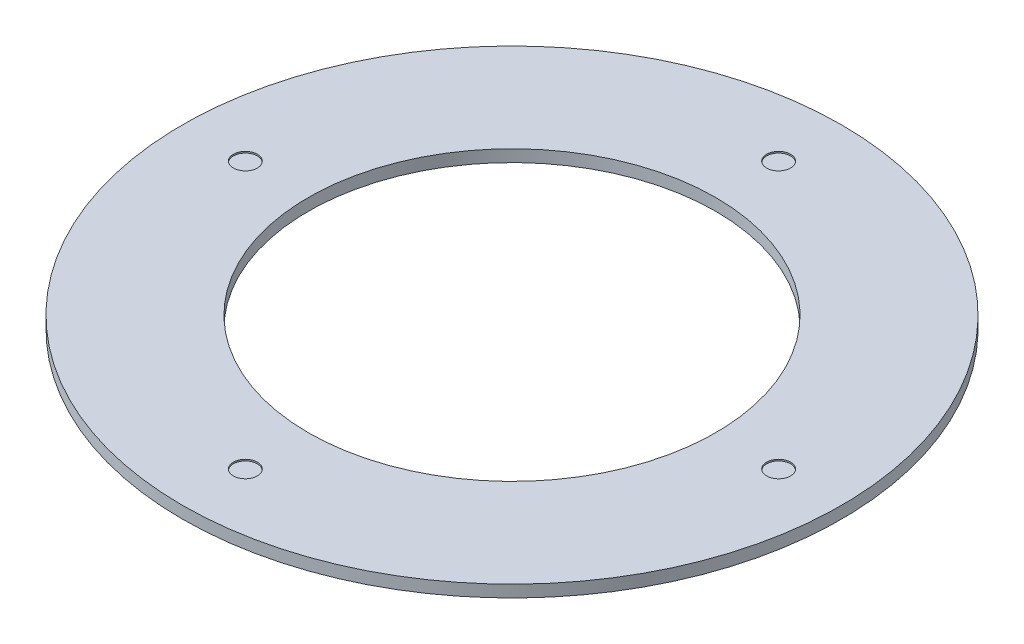
ISO-10303-21;
HEADER;
FILE_DESCRIPTION(('STEP AP214'),'2;1');
FILE_NAME('part.step','',(''),(''),'','','');
FILE_SCHEMA(('AUTOMOTIVE_DESIGN { 1 0 10303 214 1 1 1 1 }'));
ENDSEC;
DATA;
#1=APPLICATION_CONTEXT('core data for automotive mechanical design processes');
#2=APPLICATION_PROTOCOL_DEFINITION('international standard','automotive_design',2000,#1);
#3=PRODUCT_CONTEXT('',#1,'mechanical');
#4=PRODUCT('Part','Part','',(#3));
#5=PRODUCT_RELATED_PRODUCT_CATEGORY('part','',(#4));
#6=PRODUCT_DEFINITION_FORMATION('','',#4);
#7=PRODUCT_DEFINITION_CONTEXT('part definition',#1,'design');
#8=PRODUCT_DEFINITION('design','',#6,#7);
#9=PRODUCT_DEFINITION_SHAPE('','',#8);
#10=(LENGTH_UNIT() NAMED_UNIT(*) SI_UNIT(.MILLI.,.METRE.));
#11=(NAMED_UNIT(*) PLANE_ANGLE_UNIT() SI_UNIT($,.RADIAN.));
#12=(NAMED_UNIT(*) SI_UNIT($,.STERADIAN.) SOLID_ANGLE_UNIT());
#13=UNCERTAINTY_MEASURE_WITH_UNIT(LENGTH_MEASURE(1.E-05),#10,'distance_accuracy_value','');
#14=(GEOMETRIC_REPRESENTATION_CONTEXT(3) GLOBAL_UNCERTAINTY_ASSIGNED_CONTEXT((#13)) GLOBAL_UNIT_ASSIGNED_CONTEXT((#10,
#11,#12)) REPRESENTATION_CONTEXT('',''));
#15=CARTESIAN_POINT('',(0.,0.,0.));
#16=DIRECTION('',(0.,0.,1.));
#17=DIRECTION('',(1.,0.,0.));
#18=AXIS2_PLACEMENT_3D('',#15,#16,#17);
#19=CARTESIAN_POINT('',(0.,2.,0.));
#20=DIRECTION('',(0.,-1.,0.));
#21=DIRECTION('',(0.,0.,-1.));
#22=AXIS2_PLACEMENT_3D('',#19,#20,#21);
#23=CYLINDRICAL_SURFACE('',#22,55.);
#24=CARTESIAN_POINT('',(0.,2.,0.));
#25=DIRECTION('',(0.,1.,0.));
#26=DIRECTION('',(0.,0.,1.));
#27=AXIS2_PLACEMENT_3D('',#24,#25,#26);
#28=CIRCLE('',#27,55.);
#29=CARTESIAN_POINT('',(0.,2.,55.));
#30=VERTEX_POINT('',#29);
#31=EDGE_CURVE('E10',#30,#30,#28,.T.);
#32=ORIENTED_EDGE('',*,*,#31,.F.);
#33=EDGE_LOOP('',(#32));
#34=FACE_BOUND('',#33,.T.);
#35=CARTESIAN_POINT('',(0.,0.,0.));
#36=DIRECTION('',(0.,1.,0.));
#37=DIRECTION('',(0.,0.,1.));
#38=AXIS2_PLACEMENT_3D('',#35,#36,#37);
#39=CIRCLE('',#38,55.);
#40=CARTESIAN_POINT('',(0.,0.,55.));
#41=VERTEX_POINT('',#40);
#42=EDGE_CURVE('E44',#41,#41,#39,.T.);
#43=ORIENTED_EDGE('',*,*,#42,.T.);
#44=EDGE_LOOP('',(#43));
#45=FACE_BOUND('',#44,.T.);
#46=ADVANCED_FACE('F36',(#34,#45),#23,.T.);
#47=CARTESIAN_POINT('',(0.,2.,0.));
#48=DIRECTION('',(0.,1.,0.));
#49=DIRECTION('',(0.,0.,1.));
#50=AXIS2_PLACEMENT_3D('',#47,#48,#49);
#51=PLANE('',#50);
#52=CARTESIAN_POINT('',(0.,2.,0.));
#53=DIRECTION('',(0.,1.,0.));
#54=DIRECTION('',(0.,0.,1.));
#55=AXIS2_PLACEMENT_3D('',#52,#53,#54);
#56=CIRCLE('',#55,34.);
#57=CARTESIAN_POINT('',(0.,2.,34.));
#58=VERTEX_POINT('',#57);
#59=EDGE_CURVE('E83',#58,#58,#56,.T.);
#60=ORIENTED_EDGE('',*,*,#59,.F.);
#61=EDGE_LOOP('',(#60));
#62=FACE_BOUND('',#61,.T.);
#63=CARTESIAN_POINT('',(0.,2.,44.5));
#64=DIRECTION('',(0.,1.,0.));
#65=DIRECTION('',(0.,0.,1.));
#66=AXIS2_PLACEMENT_3D('',#63,#64,#65);
#67=CIRCLE('',#66,2.);
#68=CARTESIAN_POINT('',(0.,2.,46.5));
#69=VERTEX_POINT('',#68);
#70=EDGE_CURVE('E76',#69,#69,#67,.T.);
#71=ORIENTED_EDGE('',*,*,#70,.F.);
#72=EDGE_LOOP('',(#71));
#73=FACE_BOUND('',#72,.T.);
#74=CARTESIAN_POINT('',(44.5,2.,0.));
#75=DIRECTION('',(0.,1.,0.));
#76=DIRECTION('',(0.,0.,1.));
#77=AXIS2_PLACEMENT_3D('',#74,#75,#76);
#78=CIRCLE('',#77,2.);
#79=CARTESIAN_POINT('',(44.5,2.,2.));
#80=VERTEX_POINT('',#79);
#81=EDGE_CURVE('E72',#80,#80,#78,.T.);
#82=ORIENTED_EDGE('',*,*,#81,.F.);
#83=EDGE_LOOP('',(#82));
#84=FACE_BOUND('',#83,.T.);
#85=CARTESIAN_POINT('',(0.,2.,-44.5));
#86=DIRECTION('',(0.,1.,0.));
#87=DIRECTION('',(0.,0.,1.));
#88=AXIS2_PLACEMENT_3D('',#85,#86,#87);
#89=CIRCLE('',#88,2.);
#90=CARTESIAN_POINT('',(0.,2.,-42.5));
#91=VERTEX_POINT('',#90);
#92=EDGE_CURVE('E64',#91,#91,#89,.T.);
#93=ORIENTED_EDGE('',*,*,#92,.F.);
#94=EDGE_LOOP('',(#93));
#95=FACE_BOUND('',#94,.T.);
#96=CARTESIAN_POINT('',(-44.5,2.,0.));
#97=DIRECTION('',(0.,1.,0.));
#98=DIRECTION('',(0.,0.,1.));
#99=AXIS2_PLACEMENT_3D('',#96,#97,#98);
#100=CIRCLE('',#99,2.);
#101=CARTESIAN_POINT('',(-44.5,2.,2.));
#102=VERTEX_POINT('',#101);
#103=EDGE_CURVE('E56',#102,#102,#100,.T.);
#104=ORIENTED_EDGE('',*,*,#103,.F.);
#105=EDGE_LOOP('',(#104));
#106=FACE_BOUND('',#105,.T.);
#107=ORIENTED_EDGE('',*,*,#31,.T.);
#108=EDGE_LOOP('',(#107));
#109=FACE_BOUND('',#108,.T.);
#110=ADVANCED_FACE('F106',(#62,#73,#84,#95,#106,#109),#51,.T.);
#111=CARTESIAN_POINT('',(0.,0.,0.));
#112=DIRECTION('',(0.,1.,0.));
#113=DIRECTION('',(0.,0.,1.));
#114=AXIS2_PLACEMENT_3D('',#111,#112,#113);
#115=PLANE('',#114);
#116=CARTESIAN_POINT('',(0.,0.,0.));
#117=DIRECTION('',(0.,1.,0.));
#118=DIRECTION('',(0.,0.,1.));
#119=AXIS2_PLACEMENT_3D('',#116,#117,#118);
#120=CIRCLE('',#119,34.);
#121=CARTESIAN_POINT('',(0.,0.,34.));
#122=VERTEX_POINT('',#121);
#123=EDGE_CURVE('E39',#122,#122,#120,.T.);
#124=ORIENTED_EDGE('',*,*,#123,.T.);
#125=EDGE_LOOP('',(#124));
#126=FACE_BOUND('',#125,.T.);
#127=ORIENTED_EDGE('',*,*,#42,.F.);
#128=EDGE_LOOP('',(#127));
#129=FACE_BOUND('',#128,.T.);
#130=ADVANCED_FACE('F92',(#126,#129),#115,.F.);
#131=CARTESIAN_POINT('',(-44.5,1.75,0.));
#132=DIRECTION('',(0.,1.,0.));
#133=DIRECTION('',(0.,0.,1.));
#134=AXIS2_PLACEMENT_3D('',#131,#132,#133);
#135=CYLINDRICAL_SURFACE('',#134,2.);
#136=CARTESIAN_POINT('',(-44.5,1.75,0.));
#137=DIRECTION('',(0.,1.,0.));
#138=DIRECTION('',(0.,0.,1.));
#139=AXIS2_PLACEMENT_3D('',#136,#137,#138);
#140=CIRCLE('',#139,2.);
#141=CARTESIAN_POINT('',(-44.5,1.75,2.));
#142=VERTEX_POINT('',#141);
#143=EDGE_CURVE('E52',#142,#142,#140,.T.);
#144=ORIENTED_EDGE('',*,*,#143,.F.);
#145=EDGE_LOOP('',(#144));
#146=FACE_BOUND('',#145,.T.);
#147=ORIENTED_EDGE('',*,*,#103,.T.);
#148=EDGE_LOOP('',(#147));
#149=FACE_BOUND('',#148,.T.);
#150=ADVANCED_FACE('F117',(#146,#149),#135,.F.);
#151=CARTESIAN_POINT('',(-44.5,1.75,0.));
#152=DIRECTION('',(0.,1.,0.));
#153=DIRECTION('',(0.,0.,1.));
#154=AXIS2_PLACEMENT_3D('',#151,#152,#153);
#155=PLANE('',#154);
#156=ORIENTED_EDGE('',*,*,#143,.T.);
#157=EDGE_LOOP('',(#156));
#158=FACE_BOUND('',#157,.T.);
#159=ADVANCED_FACE('F121',(#158),#155,.T.);
#160=CARTESIAN_POINT('',(0.,1.75,-44.5));
#161=DIRECTION('',(0.,1.,0.));
#162=DIRECTION('',(0.,0.,1.));
#163=AXIS2_PLACEMENT_3D('',#160,#161,#162);
#164=CYLINDRICAL_SURFACE('',#163,2.);
#165=CARTESIAN_POINT('',(0.,1.75,-44.5));
#166=DIRECTION('',(0.,1.,0.));
#167=DIRECTION('',(0.,0.,1.));
#168=AXIS2_PLACEMENT_3D('',#165,#166,#167);
#169=CIRCLE('',#168,2.);
#170=CARTESIAN_POINT('',(0.,1.75,-42.5));
#171=VERTEX_POINT('',#170);
#172=EDGE_CURVE('E60',#171,#171,#169,.T.);
#173=ORIENTED_EDGE('',*,*,#172,.F.);
#174=EDGE_LOOP('',(#173));
#175=FACE_BOUND('',#174,.T.);
#176=ORIENTED_EDGE('',*,*,#92,.T.);
#177=EDGE_LOOP('',(#176));
#178=FACE_BOUND('',#177,.T.);
#179=ADVANCED_FACE('F126',(#175,#178),#164,.F.);
#180=CARTESIAN_POINT('',(0.,1.75,-44.5));
#181=DIRECTION('',(0.,1.,0.));
#182=DIRECTION('',(0.,0.,1.));
#183=AXIS2_PLACEMENT_3D('',#180,#181,#182);
#184=PLANE('',#183);
#185=ORIENTED_EDGE('',*,*,#172,.T.);
#186=EDGE_LOOP('',(#185));
#187=FACE_BOUND('',#186,.T.);
#188=ADVANCED_FACE('F129',(#187),#184,.T.);
#189=CARTESIAN_POINT('',(44.5,1.75,0.));
#190=DIRECTION('',(0.,1.,0.));
#191=DIRECTION('',(0.,0.,1.));
#192=AXIS2_PLACEMENT_3D('',#189,#190,#191);
#193=CYLINDRICAL_SURFACE('',#192,2.);
#194=CARTESIAN_POINT('',(44.5,1.75,0.));
#195=DIRECTION('',(0.,1.,0.));
#196=DIRECTION('',(0.,0.,1.));
#197=AXIS2_PLACEMENT_3D('',#194,#195,#196);
#198=CIRCLE('',#197,2.);
#199=CARTESIAN_POINT('',(44.5,1.75,2.));
#200=VERTEX_POINT('',#199);
#201=EDGE_CURVE('E68',#200,#200,#198,.T.);
#202=ORIENTED_EDGE('',*,*,#201,.F.);
#203=EDGE_LOOP('',(#202));
#204=FACE_BOUND('',#203,.T.);
#205=ORIENTED_EDGE('',*,*,#81,.T.);
#206=EDGE_LOOP('',(#205));
#207=FACE_BOUND('',#206,.T.);
#208=ADVANCED_FACE('F132',(#204,#207),#193,.F.);
#209=CARTESIAN_POINT('',(44.5,1.75,0.));
#210=DIRECTION('',(0.,1.,0.));
#211=DIRECTION('',(0.,0.,1.));
#212=AXIS2_PLACEMENT_3D('',#209,#210,#211);
#213=PLANE('',#212);
#214=ORIENTED_EDGE('',*,*,#201,.T.);
#215=EDGE_LOOP('',(#214));
#216=FACE_BOUND('',#215,.T.);
#217=ADVANCED_FACE('F137',(#216),#213,.T.);
#218=CARTESIAN_POINT('',(0.,1.75,44.5));
#219=DIRECTION('',(0.,1.,0.));
#220=DIRECTION('',(0.,0.,1.));
#221=AXIS2_PLACEMENT_3D('',#218,#219,#220);
#222=CYLINDRICAL_SURFACE('',#221,2.);
#223=CARTESIAN_POINT('',(0.,1.75,44.5));
#224=DIRECTION('',(0.,1.,0.));
#225=DIRECTION('',(0.,0.,1.));
#226=AXIS2_PLACEMENT_3D('',#223,#224,#225);
#227=CIRCLE('',#226,2.);
#228=CARTESIAN_POINT('',(0.,1.75,46.5));
#229=VERTEX_POINT('',#228);
#230=EDGE_CURVE('E50',#229,#229,#227,.T.);
#231=ORIENTED_EDGE('',*,*,#230,.F.);
#232=EDGE_LOOP('',(#231));
#233=FACE_BOUND('',#232,.T.);
#234=ORIENTED_EDGE('',*,*,#70,.T.);
#235=EDGE_LOOP('',(#234));
#236=FACE_BOUND('',#235,.T.);
#237=ADVANCED_FACE('F102',(#233,#236),#222,.F.);
#238=CARTESIAN_POINT('',(0.,1.75,0.));
#239=DIRECTION('',(0.,1.,0.));
#240=DIRECTION('',(0.,0.,1.));
#241=AXIS2_PLACEMENT_3D('',#238,#239,#240);
#242=PLANE('',#241);
#243=ORIENTED_EDGE('',*,*,#230,.T.);
#244=EDGE_LOOP('',(#243));
#245=FACE_BOUND('',#244,.T.);
#246=ADVANCED_FACE('F97',(#245),#242,.T.);
#247=CARTESIAN_POINT('',(0.,-8.,0.));
#248=DIRECTION('',(0.,1.,0.));
#249=DIRECTION('',(0.,0.,1.));
#250=AXIS2_PLACEMENT_3D('',#247,#248,#249);
#251=CYLINDRICAL_SURFACE('',#250,34.);
#252=ORIENTED_EDGE('',*,*,#59,.T.);
#253=EDGE_LOOP('',(#252));
#254=FACE_BOUND('',#253,.T.);
#255=ORIENTED_EDGE('',*,*,#123,.F.);
#256=EDGE_LOOP('',(#255));
#257=FACE_BOUND('',#256,.T.);
#258=ADVANCED_FACE('F95',(#254,#257),#251,.F.);
#259=CLOSED_SHELL('',(#46,#110,#130,#150,#159,#179,#188,#208,#217,#237,#246,#258));
#260=MANIFOLD_SOLID_BREP('B2',#259);
#261=ADVANCED_BREP_SHAPE_REPRESENTATION('',(#18,#260),#14);
#262=SHAPE_DEFINITION_REPRESENTATION(#9,#261);
ENDSEC;
END-ISO-10303-21;
